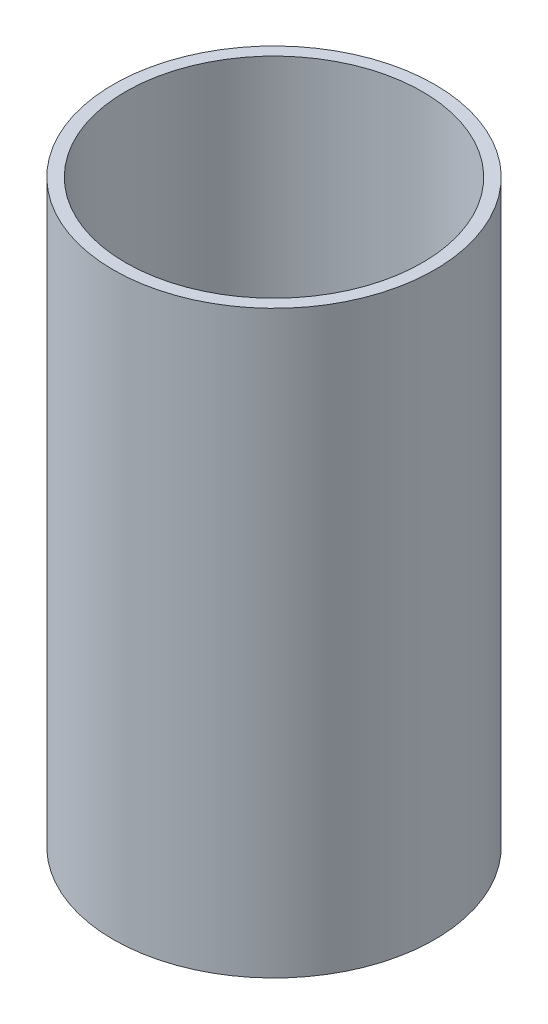
ISO-10303-21;
HEADER;
FILE_DESCRIPTION(('STEP AP214'),'2;1');
FILE_NAME('part.step','',(''),(''),'','','');
FILE_SCHEMA(('AUTOMOTIVE_DESIGN { 1 0 10303 214 1 1 1 1 }'));
ENDSEC;
DATA;
#1=APPLICATION_CONTEXT('core data for automotive mechanical design processes');
#2=APPLICATION_PROTOCOL_DEFINITION('international standard','automotive_design',2000,#1);
#3=PRODUCT_CONTEXT('',#1,'mechanical');
#4=PRODUCT('Part','Part','',(#3));
#5=PRODUCT_RELATED_PRODUCT_CATEGORY('part','',(#4));
#6=PRODUCT_DEFINITION_FORMATION('','',#4);
#7=PRODUCT_DEFINITION_CONTEXT('part definition',#1,'design');
#8=PRODUCT_DEFINITION('design','',#6,#7);
#9=PRODUCT_DEFINITION_SHAPE('','',#8);
#10=(LENGTH_UNIT() NAMED_UNIT(*) SI_UNIT(.MILLI.,.METRE.));
#11=(NAMED_UNIT(*) PLANE_ANGLE_UNIT() SI_UNIT($,.RADIAN.));
#12=(NAMED_UNIT(*) SI_UNIT($,.STERADIAN.) SOLID_ANGLE_UNIT());
#13=UNCERTAINTY_MEASURE_WITH_UNIT(LENGTH_MEASURE(1.E-05),#10,'distance_accuracy_value','');
#14=(GEOMETRIC_REPRESENTATION_CONTEXT(3) GLOBAL_UNCERTAINTY_ASSIGNED_CONTEXT((#13)) GLOBAL_UNIT_ASSIGNED_CONTEXT((#10,
#11,#12)) REPRESENTATION_CONTEXT('',''));
#15=CARTESIAN_POINT('',(0.,0.,0.));
#16=DIRECTION('',(0.,0.,1.));
#17=DIRECTION('',(1.,0.,0.));
#18=AXIS2_PLACEMENT_3D('',#15,#16,#17);
#19=CARTESIAN_POINT('',(0.,149.,0.));
#20=DIRECTION('',(0.,1.,0.));
#21=DIRECTION('',(0.,0.,1.));
#22=AXIS2_PLACEMENT_3D('',#19,#20,#21);
#23=PLANE('',#22);
#24=CARTESIAN_POINT('',(0.,149.,0.));
#25=DIRECTION('',(0.,1.,0.));
#26=DIRECTION('',(0.,0.,1.));
#27=AXIS2_PLACEMENT_3D('',#24,#25,#26);
#28=CIRCLE('',#27,82.55);
#29=CARTESIAN_POINT('',(0.,149.,82.55));
#30=VERTEX_POINT('',#29);
#31=EDGE_CURVE('E10',#30,#30,#28,.T.);
#32=ORIENTED_EDGE('',*,*,#31,.T.);
#33=EDGE_LOOP('',(#32));
#34=FACE_BOUND('',#33,.T.);
#35=CARTESIAN_POINT('',(0.,149.,0.));
#36=DIRECTION('',(0.,1.,0.));
#37=DIRECTION('',(0.,0.,1.));
#38=AXIS2_PLACEMENT_3D('',#35,#36,#37);
#39=CIRCLE('',#38,76.2);
#40=CARTESIAN_POINT('',(0.,149.,76.2));
#41=VERTEX_POINT('',#40);
#42=EDGE_CURVE('E43',#41,#41,#39,.T.);
#43=ORIENTED_EDGE('',*,*,#42,.F.);
#44=EDGE_LOOP('',(#43));
#45=FACE_BOUND('',#44,.T.);
#46=ADVANCED_FACE('F32',(#34,#45),#23,.T.);
#47=CARTESIAN_POINT('',(0.,-149.,0.));
#48=DIRECTION('',(0.,1.,0.));
#49=DIRECTION('',(0.,0.,1.));
#50=AXIS2_PLACEMENT_3D('',#47,#48,#49);
#51=PLANE('',#50);
#52=CARTESIAN_POINT('',(0.,-149.,0.));
#53=DIRECTION('',(0.,1.,0.));
#54=DIRECTION('',(0.,0.,1.));
#55=AXIS2_PLACEMENT_3D('',#52,#53,#54);
#56=CIRCLE('',#55,82.55);
#57=CARTESIAN_POINT('',(0.,-149.,82.55));
#58=VERTEX_POINT('',#57);
#59=EDGE_CURVE('E36',#58,#58,#56,.T.);
#60=ORIENTED_EDGE('',*,*,#59,.F.);
#61=EDGE_LOOP('',(#60));
#62=FACE_BOUND('',#61,.T.);
#63=CARTESIAN_POINT('',(0.,-149.,0.));
#64=DIRECTION('',(0.,1.,0.));
#65=DIRECTION('',(0.,0.,1.));
#66=AXIS2_PLACEMENT_3D('',#63,#64,#65);
#67=CIRCLE('',#66,76.2);
#68=CARTESIAN_POINT('',(0.,-149.,76.2));
#69=VERTEX_POINT('',#68);
#70=EDGE_CURVE('E45',#69,#69,#67,.T.);
#71=ORIENTED_EDGE('',*,*,#70,.T.);
#72=EDGE_LOOP('',(#71));
#73=FACE_BOUND('',#72,.T.);
#74=ADVANCED_FACE('F55',(#62,#73),#51,.F.);
#75=CARTESIAN_POINT('',(0.,149.,0.));
#76=DIRECTION('',(0.,-1.,0.));
#77=DIRECTION('',(0.,0.,-1.));
#78=AXIS2_PLACEMENT_3D('',#75,#76,#77);
#79=CYLINDRICAL_SURFACE('',#78,82.55);
#80=ORIENTED_EDGE('',*,*,#31,.F.);
#81=EDGE_LOOP('',(#80));
#82=FACE_BOUND('',#81,.T.);
#83=ORIENTED_EDGE('',*,*,#59,.T.);
#84=EDGE_LOOP('',(#83));
#85=FACE_BOUND('',#84,.T.);
#86=ADVANCED_FACE('F34',(#82,#85),#79,.T.);
#87=CARTESIAN_POINT('',(0.,149.,0.));
#88=DIRECTION('',(0.,-1.,0.));
#89=DIRECTION('',(0.,0.,-1.));
#90=AXIS2_PLACEMENT_3D('',#87,#88,#89);
#91=CYLINDRICAL_SURFACE('',#90,76.2);
#92=ORIENTED_EDGE('',*,*,#42,.T.);
#93=EDGE_LOOP('',(#92));
#94=FACE_BOUND('',#93,.T.);
#95=ORIENTED_EDGE('',*,*,#70,.F.);
#96=EDGE_LOOP('',(#95));
#97=FACE_BOUND('',#96,.T.);
#98=ADVANCED_FACE('F51',(#94,#97),#91,.F.);
#99=CLOSED_SHELL('',(#46,#74,#86,#98));
#100=MANIFOLD_SOLID_BREP('B2',#99);
#101=ADVANCED_BREP_SHAPE_REPRESENTATION('',(#18,#100),#14);
#102=SHAPE_DEFINITION_REPRESENTATION(#9,#101);
ENDSEC;
END-ISO-10303-21;
